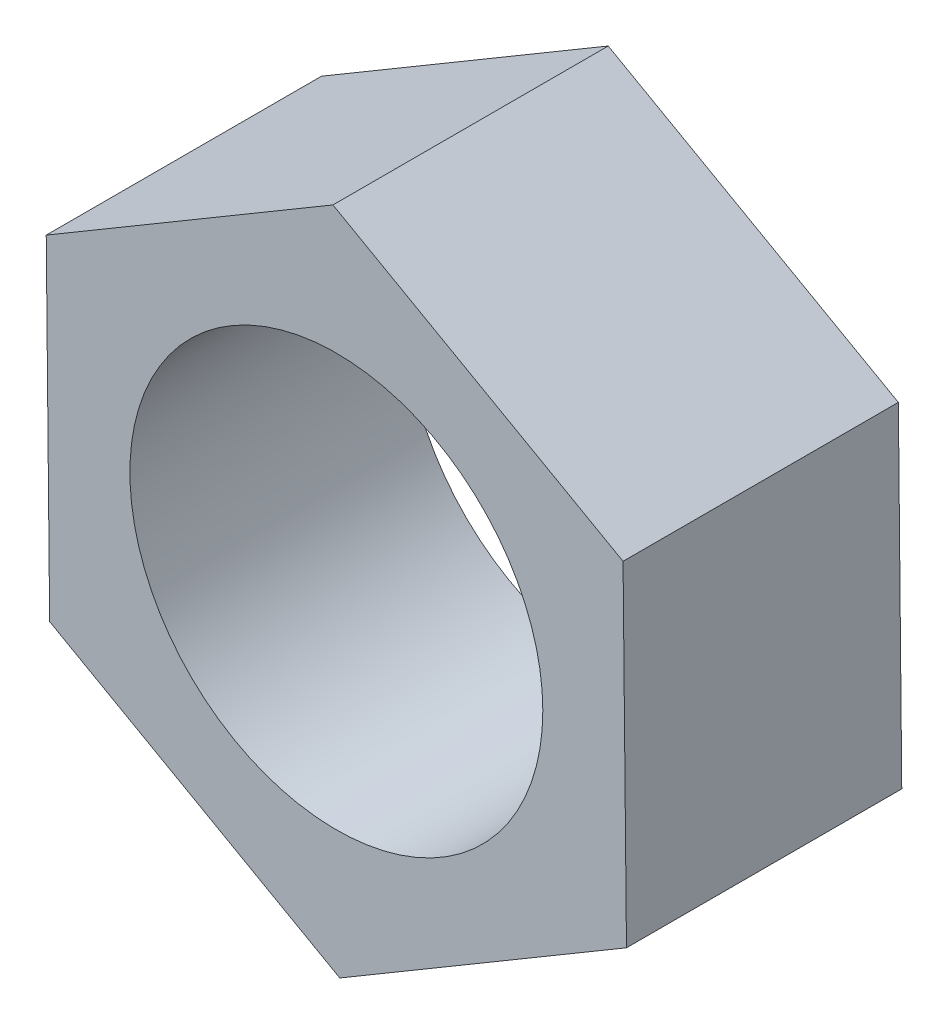
ISO-10303-21;
HEADER;
FILE_DESCRIPTION(('STEP AP214'),'2;1');
FILE_NAME('part.step','',(''),(''),'','','');
FILE_SCHEMA(('AUTOMOTIVE_DESIGN { 1 0 10303 214 1 1 1 1 }'));
ENDSEC;
DATA;
#1=APPLICATION_CONTEXT('core data for automotive mechanical design processes');
#2=APPLICATION_PROTOCOL_DEFINITION('international standard','automotive_design',2000,#1);
#3=PRODUCT_CONTEXT('',#1,'mechanical');
#4=PRODUCT('Part','Part','',(#3));
#5=PRODUCT_RELATED_PRODUCT_CATEGORY('part','',(#4));
#6=PRODUCT_DEFINITION_FORMATION('','',#4);
#7=PRODUCT_DEFINITION_CONTEXT('part definition',#1,'design');
#8=PRODUCT_DEFINITION('design','',#6,#7);
#9=PRODUCT_DEFINITION_SHAPE('','',#8);
#10=(LENGTH_UNIT() NAMED_UNIT(*) SI_UNIT(.MILLI.,.METRE.));
#11=(NAMED_UNIT(*) PLANE_ANGLE_UNIT() SI_UNIT($,.RADIAN.));
#12=(NAMED_UNIT(*) SI_UNIT($,.STERADIAN.) SOLID_ANGLE_UNIT());
#13=UNCERTAINTY_MEASURE_WITH_UNIT(LENGTH_MEASURE(1.E-05),#10,'distance_accuracy_value','');
#14=(GEOMETRIC_REPRESENTATION_CONTEXT(3) GLOBAL_UNCERTAINTY_ASSIGNED_CONTEXT((#13)) GLOBAL_UNIT_ASSIGNED_CONTEXT((#10,
#11,#12)) REPRESENTATION_CONTEXT('',''));
#15=CARTESIAN_POINT('',(0.,0.,0.));
#16=DIRECTION('',(0.,0.,1.));
#17=DIRECTION('',(1.,0.,0.));
#18=AXIS2_PLACEMENT_3D('',#15,#16,#17);
#19=CARTESIAN_POINT('',(0.,0.,2.));
#20=DIRECTION('',(0.,0.,1.));
#21=DIRECTION('',(1.,0.,0.));
#22=AXIS2_PLACEMENT_3D('',#19,#20,#21);
#23=PLANE('',#22);
#24=DIRECTION('',(-0.0102804443309658,0.999947154835873,0.));
#25=VECTOR('',#24,1.);
#26=CARTESIAN_POINT('',(2.10779363614858,-1.18821211546322,2.));
#27=LINE('',#26,#25);
#28=CARTESIAN_POINT('',(2.10779363614858,-1.18821211546322,2.));
#29=VERTEX_POINT('',#28);
#30=CARTESIAN_POINT('',(2.08291869514989,1.23129677710824,2.));
#31=VERTEX_POINT('',#30);
#32=EDGE_CURVE('E131',#29,#31,#27,.T.);
#33=ORIENTED_EDGE('',*,*,#32,.T.);
#34=DIRECTION('',(-0.87111986069532,0.491070451465129,0.));
#35=VECTOR('',#34,1.);
#36=CARTESIAN_POINT('',(2.08291869514989,1.23129677710824,2.));
#37=LINE('',#36,#35);
#38=CARTESIAN_POINT('',(-0.0248749409986961,2.41950889257145,2.));
#39=VERTEX_POINT('',#38);
#40=EDGE_CURVE('E89',#31,#39,#37,.T.);
#41=ORIENTED_EDGE('',*,*,#40,.T.);
#42=DIRECTION('',(-0.860839416364355,-0.508876703370745,0.));
#43=VECTOR('',#42,1.);
#44=CARTESIAN_POINT('',(-0.0248749409986961,2.41950889257145,2.));
#45=LINE('',#44,#43);
#46=CARTESIAN_POINT('',(-2.10779363614858,1.18821211546322,2.));
#47=VERTEX_POINT('',#46);
#48=EDGE_CURVE('E102',#39,#47,#45,.T.);
#49=ORIENTED_EDGE('',*,*,#48,.T.);
#50=DIRECTION('',(0.0102804443309656,-0.999947154835873,0.));
#51=VECTOR('',#50,1.);
#52=CARTESIAN_POINT('',(-2.10779363614858,1.18821211546322,2.));
#53=LINE('',#52,#51);
#54=CARTESIAN_POINT('',(-2.08291869514988,-1.23129677710824,2.));
#55=VERTEX_POINT('',#54);
#56=EDGE_CURVE('E96',#47,#55,#53,.T.);
#57=ORIENTED_EDGE('',*,*,#56,.T.);
#58=DIRECTION('',(0.871119860695321,-0.491070451465129,0.));
#59=VECTOR('',#58,1.);
#60=CARTESIAN_POINT('',(-2.08291869514988,-1.23129677710824,2.));
#61=LINE('',#60,#59);
#62=CARTESIAN_POINT('',(0.0248749409986967,-2.41950889257146,2.));
#63=VERTEX_POINT('',#62);
#64=EDGE_CURVE('E100',#55,#63,#61,.T.);
#65=ORIENTED_EDGE('',*,*,#64,.T.);
#66=DIRECTION('',(0.860839416364355,0.508876703370745,0.));
#67=VECTOR('',#66,1.);
#68=CARTESIAN_POINT('',(0.0248749409986967,-2.41950889257146,2.));
#69=LINE('',#68,#67);
#70=EDGE_CURVE('E52',#63,#29,#69,.T.);
#71=ORIENTED_EDGE('',*,*,#70,.T.);
#72=EDGE_LOOP('',(#33,#41,#49,#57,#65,#71));
#73=FACE_BOUND('',#72,.T.);
#74=CARTESIAN_POINT('',(0.,0.,2.));
#75=DIRECTION('',(0.,0.,1.));
#76=DIRECTION('',(1.,0.,0.));
#77=AXIS2_PLACEMENT_3D('',#74,#75,#76);
#78=CIRCLE('',#77,1.5);
#79=CARTESIAN_POINT('',(1.5,0.,2.));
#80=VERTEX_POINT('',#79);
#81=EDGE_CURVE('E124',#80,#80,#78,.T.);
#82=ORIENTED_EDGE('',*,*,#81,.F.);
#83=EDGE_LOOP('',(#82));
#84=FACE_BOUND('',#83,.T.);
#85=ADVANCED_FACE('F35',(#73,#84),#23,.T.);
#86=CARTESIAN_POINT('',(0.,0.,0.));
#87=DIRECTION('',(0.,0.,1.));
#88=DIRECTION('',(1.,0.,0.));
#89=AXIS2_PLACEMENT_3D('',#86,#87,#88);
#90=PLANE('',#89);
#91=DIRECTION('',(-0.0102804443309658,0.999947154835873,0.));
#92=VECTOR('',#91,1.);
#93=CARTESIAN_POINT('',(2.10779363614858,-1.18821211546322,0.));
#94=LINE('',#93,#92);
#95=CARTESIAN_POINT('',(2.10779363614858,-1.18821211546322,0.));
#96=VERTEX_POINT('',#95);
#97=CARTESIAN_POINT('',(2.08291869514989,1.23129677710824,0.));
#98=VERTEX_POINT('',#97);
#99=EDGE_CURVE('E120',#96,#98,#94,.T.);
#100=ORIENTED_EDGE('',*,*,#99,.F.);
#101=DIRECTION('',(0.860839416364355,0.508876703370745,0.));
#102=VECTOR('',#101,1.);
#103=CARTESIAN_POINT('',(0.0248749409986967,-2.41950889257146,0.));
#104=LINE('',#103,#102);
#105=CARTESIAN_POINT('',(0.0248749409986967,-2.41950889257146,0.));
#106=VERTEX_POINT('',#105);
#107=EDGE_CURVE('E81',#106,#96,#104,.T.);
#108=ORIENTED_EDGE('',*,*,#107,.F.);
#109=DIRECTION('',(0.871119860695321,-0.491070451465129,0.));
#110=VECTOR('',#109,1.);
#111=CARTESIAN_POINT('',(-2.08291869514988,-1.23129677710824,0.));
#112=LINE('',#111,#110);
#113=CARTESIAN_POINT('',(-2.08291869514988,-1.23129677710824,0.));
#114=VERTEX_POINT('',#113);
#115=EDGE_CURVE('E75',#114,#106,#112,.T.);
#116=ORIENTED_EDGE('',*,*,#115,.F.);
#117=DIRECTION('',(0.0102804443309656,-0.999947154835873,0.));
#118=VECTOR('',#117,1.);
#119=CARTESIAN_POINT('',(-2.10779363614858,1.18821211546322,0.));
#120=LINE('',#119,#118);
#121=CARTESIAN_POINT('',(-2.10779363614858,1.18821211546322,0.));
#122=VERTEX_POINT('',#121);
#123=EDGE_CURVE('E110',#122,#114,#120,.T.);
#124=ORIENTED_EDGE('',*,*,#123,.F.);
#125=DIRECTION('',(-0.860839416364355,-0.508876703370745,0.));
#126=VECTOR('',#125,1.);
#127=CARTESIAN_POINT('',(-0.0248749409986961,2.41950889257145,0.));
#128=LINE('',#127,#126);
#129=CARTESIAN_POINT('',(-0.0248749409986961,2.41950889257145,0.));
#130=VERTEX_POINT('',#129);
#131=EDGE_CURVE('E126',#130,#122,#128,.T.);
#132=ORIENTED_EDGE('',*,*,#131,.F.);
#133=DIRECTION('',(-0.87111986069532,0.491070451465129,0.));
#134=VECTOR('',#133,1.);
#135=CARTESIAN_POINT('',(2.08291869514989,1.23129677710824,0.));
#136=LINE('',#135,#134);
#137=EDGE_CURVE('E123',#98,#130,#136,.T.);
#138=ORIENTED_EDGE('',*,*,#137,.F.);
#139=EDGE_LOOP('',(#100,#108,#116,#124,#132,#138));
#140=FACE_BOUND('',#139,.T.);
#141=CARTESIAN_POINT('',(0.,0.,0.));
#142=DIRECTION('',(0.,0.,1.));
#143=DIRECTION('',(1.,0.,0.));
#144=AXIS2_PLACEMENT_3D('',#141,#142,#143);
#145=CIRCLE('',#144,1.5);
#146=CARTESIAN_POINT('',(1.5,0.,0.));
#147=VERTEX_POINT('',#146);
#148=EDGE_CURVE('E224',#147,#147,#145,.T.);
#149=ORIENTED_EDGE('',*,*,#148,.T.);
#150=EDGE_LOOP('',(#149));
#151=FACE_BOUND('',#150,.T.);
#152=ADVANCED_FACE('F140',(#140,#151),#90,.F.);
#153=CARTESIAN_POINT('',(2.10779363614858,-1.18821211546322,2.));
#154=DIRECTION('',(-0.999947154835873,-0.0102804443309658,0.));
#155=DIRECTION('',(0.0102804443309658,-0.999947154835873,0.));
#156=AXIS2_PLACEMENT_3D('',#153,#154,#155);
#157=PLANE('',#156);
#158=ORIENTED_EDGE('',*,*,#99,.T.);
#159=DIRECTION('',(0.,0.,-1.));
#160=VECTOR('',#159,1.);
#161=CARTESIAN_POINT('',(2.08291869514989,1.23129677710824,2.));
#162=LINE('',#161,#160);
#163=EDGE_CURVE('E11',#31,#98,#162,.T.);
#164=ORIENTED_EDGE('',*,*,#163,.F.);
#165=ORIENTED_EDGE('',*,*,#32,.F.);
#166=DIRECTION('',(0.,0.,-1.));
#167=VECTOR('',#166,1.);
#168=CARTESIAN_POINT('',(2.10779363614858,-1.18821211546322,2.));
#169=LINE('',#168,#167);
#170=EDGE_CURVE('E116',#29,#96,#169,.T.);
#171=ORIENTED_EDGE('',*,*,#170,.T.);
#172=EDGE_LOOP('',(#158,#164,#165,#171));
#173=FACE_BOUND('',#172,.T.);
#174=ADVANCED_FACE('F37',(#173),#157,.F.);
#175=CARTESIAN_POINT('',(2.08291869514989,1.23129677710824,2.));
#176=DIRECTION('',(-0.491070451465129,-0.87111986069532,0.));
#177=DIRECTION('',(0.87111986069532,-0.491070451465129,0.));
#178=AXIS2_PLACEMENT_3D('',#175,#176,#177);
#179=PLANE('',#178);
#180=ORIENTED_EDGE('',*,*,#137,.T.);
#181=DIRECTION('',(0.,0.,-1.));
#182=VECTOR('',#181,1.);
#183=CARTESIAN_POINT('',(-0.0248749409986961,2.41950889257145,2.));
#184=LINE('',#183,#182);
#185=EDGE_CURVE('E44',#39,#130,#184,.T.);
#186=ORIENTED_EDGE('',*,*,#185,.F.);
#187=ORIENTED_EDGE('',*,*,#40,.F.);
#188=ORIENTED_EDGE('',*,*,#163,.T.);
#189=EDGE_LOOP('',(#180,#186,#187,#188));
#190=FACE_BOUND('',#189,.T.);
#191=ADVANCED_FACE('F165',(#190),#179,.F.);
#192=CARTESIAN_POINT('',(-0.0248749409986961,2.41950889257145,2.));
#193=DIRECTION('',(0.508876703370745,-0.860839416364355,0.));
#194=DIRECTION('',(0.860839416364355,0.508876703370745,0.));
#195=AXIS2_PLACEMENT_3D('',#192,#193,#194);
#196=PLANE('',#195);
#197=ORIENTED_EDGE('',*,*,#131,.T.);
#198=DIRECTION('',(0.,0.,-1.));
#199=VECTOR('',#198,1.);
#200=CARTESIAN_POINT('',(-2.10779363614858,1.18821211546322,2.));
#201=LINE('',#200,#199);
#202=EDGE_CURVE('E111',#47,#122,#201,.T.);
#203=ORIENTED_EDGE('',*,*,#202,.F.);
#204=ORIENTED_EDGE('',*,*,#48,.F.);
#205=ORIENTED_EDGE('',*,*,#185,.T.);
#206=EDGE_LOOP('',(#197,#203,#204,#205));
#207=FACE_BOUND('',#206,.T.);
#208=ADVANCED_FACE('F137',(#207),#196,.F.);
#209=CARTESIAN_POINT('',(-2.10779363614858,1.18821211546322,2.));
#210=DIRECTION('',(0.999947154835873,0.0102804443309656,0.));
#211=DIRECTION('',(-0.0102804443309656,0.999947154835873,0.));
#212=AXIS2_PLACEMENT_3D('',#209,#210,#211);
#213=PLANE('',#212);
#214=ORIENTED_EDGE('',*,*,#123,.T.);
#215=DIRECTION('',(0.,0.,-1.));
#216=VECTOR('',#215,1.);
#217=CARTESIAN_POINT('',(-2.08291869514988,-1.23129677710824,2.));
#218=LINE('',#217,#216);
#219=EDGE_CURVE('E107',#55,#114,#218,.T.);
#220=ORIENTED_EDGE('',*,*,#219,.F.);
#221=ORIENTED_EDGE('',*,*,#56,.F.);
#222=ORIENTED_EDGE('',*,*,#202,.T.);
#223=EDGE_LOOP('',(#214,#220,#221,#222));
#224=FACE_BOUND('',#223,.T.);
#225=ADVANCED_FACE('F108',(#224),#213,.F.);
#226=CARTESIAN_POINT('',(-2.08291869514988,-1.23129677710824,2.));
#227=DIRECTION('',(0.491070451465129,0.871119860695321,0.));
#228=DIRECTION('',(-0.871119860695321,0.491070451465129,0.));
#229=AXIS2_PLACEMENT_3D('',#226,#227,#228);
#230=PLANE('',#229);
#231=ORIENTED_EDGE('',*,*,#115,.T.);
#232=DIRECTION('',(0.,0.,-1.));
#233=VECTOR('',#232,1.);
#234=CARTESIAN_POINT('',(0.0248749409986967,-2.41950889257146,2.));
#235=LINE('',#234,#233);
#236=EDGE_CURVE('E112',#63,#106,#235,.T.);
#237=ORIENTED_EDGE('',*,*,#236,.F.);
#238=ORIENTED_EDGE('',*,*,#64,.F.);
#239=ORIENTED_EDGE('',*,*,#219,.T.);
#240=EDGE_LOOP('',(#231,#237,#238,#239));
#241=FACE_BOUND('',#240,.T.);
#242=ADVANCED_FACE('F114',(#241),#230,.F.);
#243=CARTESIAN_POINT('',(0.0248749409986967,-2.41950889257146,2.));
#244=DIRECTION('',(-0.508876703370745,0.860839416364355,0.));
#245=DIRECTION('',(-0.860839416364355,-0.508876703370745,0.));
#246=AXIS2_PLACEMENT_3D('',#243,#244,#245);
#247=PLANE('',#246);
#248=ORIENTED_EDGE('',*,*,#107,.T.);
#249=ORIENTED_EDGE('',*,*,#170,.F.);
#250=ORIENTED_EDGE('',*,*,#70,.F.);
#251=ORIENTED_EDGE('',*,*,#236,.T.);
#252=EDGE_LOOP('',(#248,#249,#250,#251));
#253=FACE_BOUND('',#252,.T.);
#254=ADVANCED_FACE('F145',(#253),#247,.F.);
#255=CARTESIAN_POINT('',(0.,0.,2.));
#256=DIRECTION('',(0.,0.,-1.));
#257=DIRECTION('',(-1.,0.,0.));
#258=AXIS2_PLACEMENT_3D('',#255,#256,#257);
#259=CYLINDRICAL_SURFACE('',#258,1.5);
#260=ORIENTED_EDGE('',*,*,#81,.T.);
#261=EDGE_LOOP('',(#260));
#262=FACE_BOUND('',#261,.T.);
#263=ORIENTED_EDGE('',*,*,#148,.F.);
#264=EDGE_LOOP('',(#263));
#265=FACE_BOUND('',#264,.T.);
#266=ADVANCED_FACE('F147',(#262,#265),#259,.F.);
#267=CLOSED_SHELL('',(#85,#152,#174,#191,#208,#225,#242,#254,#266));
#268=MANIFOLD_SOLID_BREP('B2',#267);
#269=ADVANCED_BREP_SHAPE_REPRESENTATION('',(#18,#268),#14);
#270=SHAPE_DEFINITION_REPRESENTATION(#9,#269);
ENDSEC;
END-ISO-10303-21;
